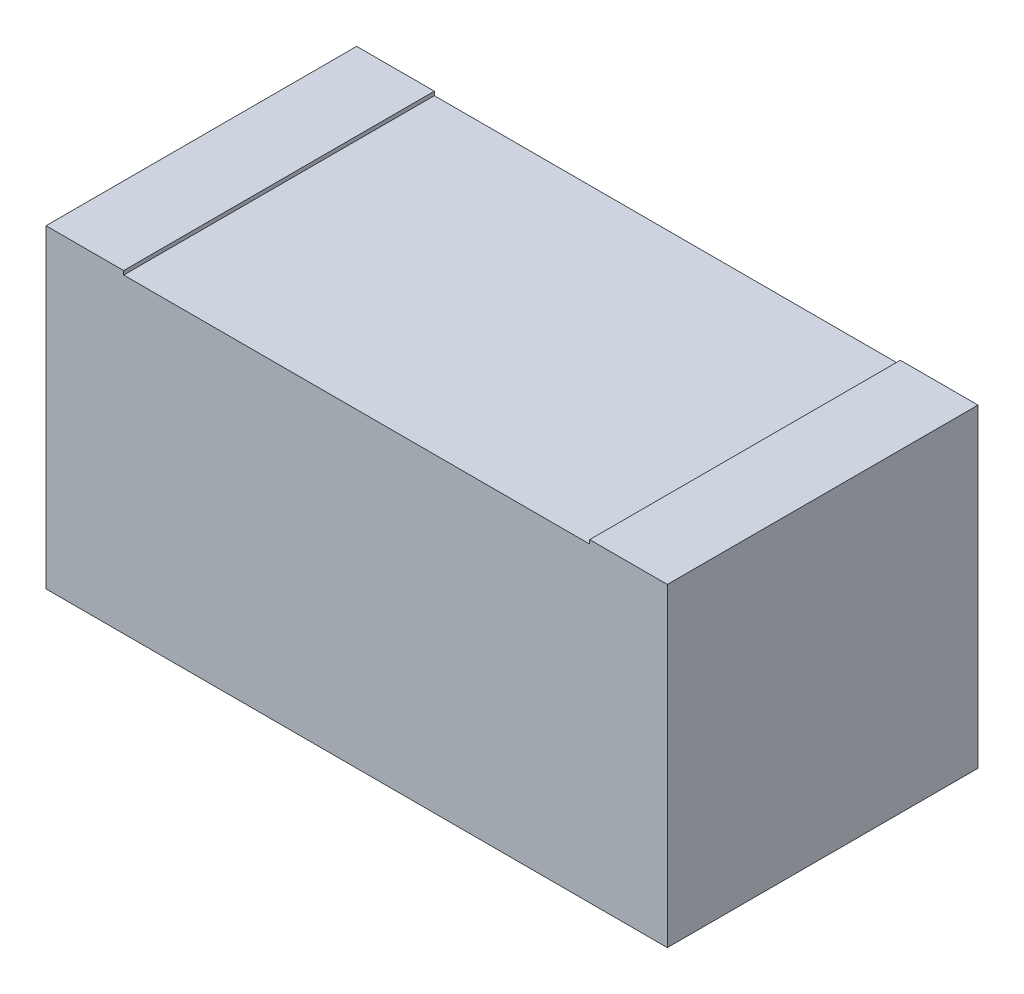
ISO-10303-21;
HEADER;
FILE_DESCRIPTION(('STEP AP214'),'2;1');
FILE_NAME('part.step','',(''),(''),'','','');
FILE_SCHEMA(('AUTOMOTIVE_DESIGN { 1 0 10303 214 1 1 1 1 }'));
ENDSEC;
DATA;
#1=APPLICATION_CONTEXT('core data for automotive mechanical design processes');
#2=APPLICATION_PROTOCOL_DEFINITION('international standard','automotive_design',2000,#1);
#3=PRODUCT_CONTEXT('',#1,'mechanical');
#4=PRODUCT('Part','Part','',(#3));
#5=PRODUCT_RELATED_PRODUCT_CATEGORY('part','',(#4));
#6=PRODUCT_DEFINITION_FORMATION('','',#4);
#7=PRODUCT_DEFINITION_CONTEXT('part definition',#1,'design');
#8=PRODUCT_DEFINITION('design','',#6,#7);
#9=PRODUCT_DEFINITION_SHAPE('','',#8);
#10=(LENGTH_UNIT() NAMED_UNIT(*) SI_UNIT(.MILLI.,.METRE.));
#11=(NAMED_UNIT(*) PLANE_ANGLE_UNIT() SI_UNIT($,.RADIAN.));
#12=(NAMED_UNIT(*) SI_UNIT($,.STERADIAN.) SOLID_ANGLE_UNIT());
#13=UNCERTAINTY_MEASURE_WITH_UNIT(LENGTH_MEASURE(1.E-05),#10,'distance_accuracy_value','');
#14=(GEOMETRIC_REPRESENTATION_CONTEXT(3) GLOBAL_UNCERTAINTY_ASSIGNED_CONTEXT((#13)) GLOBAL_UNIT_ASSIGNED_CONTEXT((#10,
#11,#12)) REPRESENTATION_CONTEXT('',''));
#15=CARTESIAN_POINT('',(0.,0.,0.));
#16=DIRECTION('',(0.,0.,1.));
#17=DIRECTION('',(1.,0.,0.));
#18=AXIS2_PLACEMENT_3D('',#15,#16,#17);
#19=CARTESIAN_POINT('',(0.,0.8,0.));
#20=DIRECTION('',(0.,1.,0.));
#21=DIRECTION('',(0.,0.,1.));
#22=AXIS2_PLACEMENT_3D('',#19,#20,#21);
#23=PLANE('',#22);
#24=DIRECTION('',(1.,0.,0.));
#25=VECTOR('',#24,1.);
#26=CARTESIAN_POINT('',(-0.853781512605042,0.8,0.430252100840336));
#27=LINE('',#26,#25);
#28=CARTESIAN_POINT('',(-0.653781512605042,0.8,0.430252100840336));
#29=VERTEX_POINT('',#28);
#30=CARTESIAN_POINT('',(0.546218487394958,0.8,0.430252100840336));
#31=VERTEX_POINT('',#30);
#32=EDGE_CURVE('E60',#29,#31,#27,.T.);
#33=ORIENTED_EDGE('',*,*,#32,.T.);
#34=DIRECTION('',(0.,0.,1.));
#35=VECTOR('',#34,1.);
#36=CARTESIAN_POINT('',(0.546218487394958,0.8,-0.369747899159664));
#37=LINE('',#36,#35);
#38=CARTESIAN_POINT('',(0.546218487394958,0.8,-0.369747899159664));
#39=VERTEX_POINT('',#38);
#40=EDGE_CURVE('E55',#39,#31,#37,.T.);
#41=ORIENTED_EDGE('',*,*,#40,.F.);
#42=DIRECTION('',(-1.,0.,0.));
#43=VECTOR('',#42,1.);
#44=CARTESIAN_POINT('',(-0.853781512605042,0.8,-0.369747899159664));
#45=LINE('',#44,#43);
#46=CARTESIAN_POINT('',(-0.653781512605042,0.8,-0.369747899159664));
#47=VERTEX_POINT('',#46);
#48=EDGE_CURVE('E158',#39,#47,#45,.T.);
#49=ORIENTED_EDGE('',*,*,#48,.T.);
#50=DIRECTION('',(0.,0.,-1.));
#51=VECTOR('',#50,1.);
#52=CARTESIAN_POINT('',(-0.653781512605042,0.8,-0.369747899159664));
#53=LINE('',#52,#51);
#54=EDGE_CURVE('E137',#29,#47,#53,.T.);
#55=ORIENTED_EDGE('',*,*,#54,.F.);
#56=EDGE_LOOP('',(#33,#41,#49,#55));
#57=FACE_BOUND('',#56,.T.);
#58=ADVANCED_FACE('F40',(#57),#23,.T.);
#59=CARTESIAN_POINT('',(-0.853781512605042,0.8,-0.369747899159664));
#60=DIRECTION('',(1.,0.,0.));
#61=DIRECTION('',(0.,0.,-1.));
#62=AXIS2_PLACEMENT_3D('',#59,#60,#61);
#63=PLANE('',#62);
#64=DIRECTION('',(0.,0.,1.));
#65=VECTOR('',#64,1.);
#66=CARTESIAN_POINT('',(-0.853781512605042,0.,-0.369747899159664));
#67=LINE('',#66,#65);
#68=CARTESIAN_POINT('',(-0.853781512605042,0.,-0.369747899159664));
#69=VERTEX_POINT('',#68);
#70=CARTESIAN_POINT('',(-0.853781512605042,0.,0.430252100840336));
#71=VERTEX_POINT('',#70);
#72=EDGE_CURVE('E156',#69,#71,#67,.T.);
#73=ORIENTED_EDGE('',*,*,#72,.T.);
#74=DIRECTION('',(0.,-1.,0.));
#75=VECTOR('',#74,1.);
#76=CARTESIAN_POINT('',(-0.853781512605042,0.8,0.430252100840336));
#77=LINE('',#76,#75);
#78=CARTESIAN_POINT('',(-0.853781512605042,0.81,0.430252100840336));
#79=VERTEX_POINT('',#78);
#80=EDGE_CURVE('E11',#79,#71,#77,.T.);
#81=ORIENTED_EDGE('',*,*,#80,.F.);
#82=DIRECTION('',(0.,0.,1.));
#83=VECTOR('',#82,1.);
#84=CARTESIAN_POINT('',(-0.853781512605042,0.81,-0.369747899159664));
#85=LINE('',#84,#83);
#86=CARTESIAN_POINT('',(-0.853781512605042,0.81,-0.369747899159664));
#87=VERTEX_POINT('',#86);
#88=EDGE_CURVE('E138',#87,#79,#85,.T.);
#89=ORIENTED_EDGE('',*,*,#88,.F.);
#90=DIRECTION('',(0.,-1.,0.));
#91=VECTOR('',#90,1.);
#92=CARTESIAN_POINT('',(-0.853781512605042,0.8,-0.369747899159664));
#93=LINE('',#92,#91);
#94=EDGE_CURVE('E113',#87,#69,#93,.T.);
#95=ORIENTED_EDGE('',*,*,#94,.T.);
#96=EDGE_LOOP('',(#73,#81,#89,#95));
#97=FACE_BOUND('',#96,.T.);
#98=ADVANCED_FACE('F42',(#97),#63,.F.);
#99=CARTESIAN_POINT('',(-0.853781512605042,0.8,0.430252100840336));
#100=DIRECTION('',(0.,0.,-1.));
#101=DIRECTION('',(-1.,0.,0.));
#102=AXIS2_PLACEMENT_3D('',#99,#100,#101);
#103=PLANE('',#102);
#104=DIRECTION('',(1.,0.,0.));
#105=VECTOR('',#104,1.);
#106=CARTESIAN_POINT('',(-0.853781512605042,0.,0.430252100840336));
#107=LINE('',#106,#105);
#108=CARTESIAN_POINT('',(0.746218487394958,0.,0.430252100840336));
#109=VERTEX_POINT('',#108);
#110=EDGE_CURVE('E163',#71,#109,#107,.T.);
#111=ORIENTED_EDGE('',*,*,#110,.T.);
#112=DIRECTION('',(0.,-1.,0.));
#113=VECTOR('',#112,1.);
#114=CARTESIAN_POINT('',(0.746218487394958,0.8,0.430252100840336));
#115=LINE('',#114,#113);
#116=CARTESIAN_POINT('',(0.746218487394958,0.81,0.430252100840336));
#117=VERTEX_POINT('',#116);
#118=EDGE_CURVE('E48',#117,#109,#115,.T.);
#119=ORIENTED_EDGE('',*,*,#118,.F.);
#120=DIRECTION('',(1.,0.,0.));
#121=VECTOR('',#120,1.);
#122=CARTESIAN_POINT('',(0.746218487394958,0.81,0.430252100840336));
#123=LINE('',#122,#121);
#124=CARTESIAN_POINT('',(0.546218487394958,0.81,0.430252100840336));
#125=VERTEX_POINT('',#124);
#126=EDGE_CURVE('E127',#125,#117,#123,.T.);
#127=ORIENTED_EDGE('',*,*,#126,.F.);
#128=DIRECTION('',(0.,-1.,0.));
#129=VECTOR('',#128,1.);
#130=CARTESIAN_POINT('',(0.546218487394958,0.81,0.430252100840336));
#131=LINE('',#130,#129);
#132=EDGE_CURVE('E132',#125,#31,#131,.T.);
#133=ORIENTED_EDGE('',*,*,#132,.T.);
#134=ORIENTED_EDGE('',*,*,#32,.F.);
#135=DIRECTION('',(0.,-1.,0.));
#136=VECTOR('',#135,1.);
#137=CARTESIAN_POINT('',(-0.653781512605042,0.81,0.430252100840336));
#138=LINE('',#137,#136);
#139=CARTESIAN_POINT('',(-0.653781512605042,0.81,0.430252100840336));
#140=VERTEX_POINT('',#139);
#141=EDGE_CURVE('E153',#140,#29,#138,.T.);
#142=ORIENTED_EDGE('',*,*,#141,.F.);
#143=DIRECTION('',(1.,0.,0.));
#144=VECTOR('',#143,1.);
#145=CARTESIAN_POINT('',(-0.853781512605042,0.81,0.430252100840336));
#146=LINE('',#145,#144);
#147=EDGE_CURVE('E141',#79,#140,#146,.T.);
#148=ORIENTED_EDGE('',*,*,#147,.F.);
#149=ORIENTED_EDGE('',*,*,#80,.T.);
#150=EDGE_LOOP('',(#111,#119,#127,#133,#134,#142,#148,#149));
#151=FACE_BOUND('',#150,.T.);
#152=ADVANCED_FACE('F183',(#151),#103,.F.);
#153=CARTESIAN_POINT('',(0.746218487394958,0.8,-0.369747899159664));
#154=DIRECTION('',(-1.,0.,0.));
#155=DIRECTION('',(0.,0.,1.));
#156=AXIS2_PLACEMENT_3D('',#153,#154,#155);
#157=PLANE('',#156);
#158=DIRECTION('',(0.,0.,-1.));
#159=VECTOR('',#158,1.);
#160=CARTESIAN_POINT('',(0.746218487394958,0.,-0.369747899159664));
#161=LINE('',#160,#159);
#162=CARTESIAN_POINT('',(0.746218487394958,0.,-0.369747899159664));
#163=VERTEX_POINT('',#162);
#164=EDGE_CURVE('E110',#109,#163,#161,.T.);
#165=ORIENTED_EDGE('',*,*,#164,.T.);
#166=DIRECTION('',(0.,-1.,0.));
#167=VECTOR('',#166,1.);
#168=CARTESIAN_POINT('',(0.746218487394958,0.8,-0.369747899159664));
#169=LINE('',#168,#167);
#170=CARTESIAN_POINT('',(0.746218487394958,0.81,-0.369747899159664));
#171=VERTEX_POINT('',#170);
#172=EDGE_CURVE('E103',#171,#163,#169,.T.);
#173=ORIENTED_EDGE('',*,*,#172,.F.);
#174=DIRECTION('',(0.,0.,-1.));
#175=VECTOR('',#174,1.);
#176=CARTESIAN_POINT('',(0.746218487394958,0.81,-0.369747899159664));
#177=LINE('',#176,#175);
#178=EDGE_CURVE('E108',#117,#171,#177,.T.);
#179=ORIENTED_EDGE('',*,*,#178,.F.);
#180=ORIENTED_EDGE('',*,*,#118,.T.);
#181=EDGE_LOOP('',(#165,#173,#179,#180));
#182=FACE_BOUND('',#181,.T.);
#183=ADVANCED_FACE('F105',(#182),#157,.F.);
#184=CARTESIAN_POINT('',(-0.853781512605042,0.8,-0.369747899159664));
#185=DIRECTION('',(0.,0.,1.));
#186=DIRECTION('',(1.,0.,0.));
#187=AXIS2_PLACEMENT_3D('',#184,#185,#186);
#188=PLANE('',#187);
#189=DIRECTION('',(-1.,0.,0.));
#190=VECTOR('',#189,1.);
#191=CARTESIAN_POINT('',(-0.853781512605042,0.,-0.369747899159664));
#192=LINE('',#191,#190);
#193=EDGE_CURVE('E159',#163,#69,#192,.T.);
#194=ORIENTED_EDGE('',*,*,#193,.T.);
#195=ORIENTED_EDGE('',*,*,#94,.F.);
#196=DIRECTION('',(-1.,0.,0.));
#197=VECTOR('',#196,1.);
#198=CARTESIAN_POINT('',(-0.853781512605042,0.81,-0.369747899159664));
#199=LINE('',#198,#197);
#200=CARTESIAN_POINT('',(-0.653781512605042,0.81,-0.369747899159664));
#201=VERTEX_POINT('',#200);
#202=EDGE_CURVE('E145',#201,#87,#199,.T.);
#203=ORIENTED_EDGE('',*,*,#202,.F.);
#204=DIRECTION('',(0.,-1.,0.));
#205=VECTOR('',#204,1.);
#206=CARTESIAN_POINT('',(-0.653781512605042,0.81,-0.369747899159664));
#207=LINE('',#206,#205);
#208=EDGE_CURVE('E148',#201,#47,#207,.T.);
#209=ORIENTED_EDGE('',*,*,#208,.T.);
#210=ORIENTED_EDGE('',*,*,#48,.F.);
#211=DIRECTION('',(0.,-1.,0.));
#212=VECTOR('',#211,1.);
#213=CARTESIAN_POINT('',(0.546218487394958,0.81,-0.369747899159664));
#214=LINE('',#213,#212);
#215=CARTESIAN_POINT('',(0.546218487394958,0.81,-0.369747899159664));
#216=VERTEX_POINT('',#215);
#217=EDGE_CURVE('E119',#216,#39,#214,.T.);
#218=ORIENTED_EDGE('',*,*,#217,.F.);
#219=DIRECTION('',(-1.,0.,0.));
#220=VECTOR('',#219,1.);
#221=CARTESIAN_POINT('',(0.746218487394958,0.81,-0.369747899159664));
#222=LINE('',#221,#220);
#223=EDGE_CURVE('E116',#171,#216,#222,.T.);
#224=ORIENTED_EDGE('',*,*,#223,.F.);
#225=ORIENTED_EDGE('',*,*,#172,.T.);
#226=EDGE_LOOP('',(#194,#195,#203,#209,#210,#218,#224,#225));
#227=FACE_BOUND('',#226,.T.);
#228=ADVANCED_FACE('F117',(#227),#188,.F.);
#229=CARTESIAN_POINT('',(0.,0.,0.));
#230=DIRECTION('',(0.,1.,0.));
#231=DIRECTION('',(0.,0.,1.));
#232=AXIS2_PLACEMENT_3D('',#229,#230,#231);
#233=PLANE('',#232);
#234=ORIENTED_EDGE('',*,*,#72,.F.);
#235=ORIENTED_EDGE('',*,*,#193,.F.);
#236=ORIENTED_EDGE('',*,*,#164,.F.);
#237=ORIENTED_EDGE('',*,*,#110,.F.);
#238=EDGE_LOOP('',(#234,#235,#236,#237));
#239=FACE_BOUND('',#238,.T.);
#240=ADVANCED_FACE('F171',(#239),#233,.F.);
#241=CARTESIAN_POINT('',(-0.653781512605042,0.81,-0.369747899159664));
#242=DIRECTION('',(-1.,0.,0.));
#243=DIRECTION('',(0.,0.,1.));
#244=AXIS2_PLACEMENT_3D('',#241,#242,#243);
#245=PLANE('',#244);
#246=ORIENTED_EDGE('',*,*,#54,.T.);
#247=ORIENTED_EDGE('',*,*,#208,.F.);
#248=DIRECTION('',(0.,0.,-1.));
#249=VECTOR('',#248,1.);
#250=CARTESIAN_POINT('',(-0.653781512605042,0.81,-0.369747899159664));
#251=LINE('',#250,#249);
#252=EDGE_CURVE('E143',#140,#201,#251,.T.);
#253=ORIENTED_EDGE('',*,*,#252,.F.);
#254=ORIENTED_EDGE('',*,*,#141,.T.);
#255=EDGE_LOOP('',(#246,#247,#253,#254));
#256=FACE_BOUND('',#255,.T.);
#257=ADVANCED_FACE('F182',(#256),#245,.F.);
#258=CARTESIAN_POINT('',(0.,0.81,0.));
#259=DIRECTION('',(0.,1.,0.));
#260=DIRECTION('',(0.,0.,1.));
#261=AXIS2_PLACEMENT_3D('',#258,#259,#260);
#262=PLANE('',#261);
#263=ORIENTED_EDGE('',*,*,#88,.T.);
#264=ORIENTED_EDGE('',*,*,#147,.T.);
#265=ORIENTED_EDGE('',*,*,#252,.T.);
#266=ORIENTED_EDGE('',*,*,#202,.T.);
#267=EDGE_LOOP('',(#263,#264,#265,#266));
#268=FACE_BOUND('',#267,.T.);
#269=ADVANCED_FACE('F177',(#268),#262,.T.);
#270=CARTESIAN_POINT('',(0.546218487394958,0.81,-0.369747899159664));
#271=DIRECTION('',(1.,0.,0.));
#272=DIRECTION('',(0.,0.,-1.));
#273=AXIS2_PLACEMENT_3D('',#270,#271,#272);
#274=PLANE('',#273);
#275=ORIENTED_EDGE('',*,*,#40,.T.);
#276=ORIENTED_EDGE('',*,*,#132,.F.);
#277=DIRECTION('',(0.,0.,1.));
#278=VECTOR('',#277,1.);
#279=CARTESIAN_POINT('',(0.546218487394958,0.81,-0.369747899159664));
#280=LINE('',#279,#278);
#281=EDGE_CURVE('E122',#216,#125,#280,.T.);
#282=ORIENTED_EDGE('',*,*,#281,.F.);
#283=ORIENTED_EDGE('',*,*,#217,.T.);
#284=EDGE_LOOP('',(#275,#276,#282,#283));
#285=FACE_BOUND('',#284,.T.);
#286=ADVANCED_FACE('F186',(#285),#274,.F.);
#287=CARTESIAN_POINT('',(0.,0.81,0.));
#288=DIRECTION('',(0.,-1.,0.));
#289=DIRECTION('',(0.,0.,-1.));
#290=AXIS2_PLACEMENT_3D('',#287,#288,#289);
#291=PLANE('',#290);
#292=ORIENTED_EDGE('',*,*,#178,.T.);
#293=ORIENTED_EDGE('',*,*,#223,.T.);
#294=ORIENTED_EDGE('',*,*,#281,.T.);
#295=ORIENTED_EDGE('',*,*,#126,.T.);
#296=EDGE_LOOP('',(#292,#293,#294,#295));
#297=FACE_BOUND('',#296,.T.);
#298=ADVANCED_FACE('F125',(#297),#291,.F.);
#299=CLOSED_SHELL('',(#58,#98,#152,#183,#228,#240,#257,#269,#286,#298));
#300=MANIFOLD_SOLID_BREP('B2',#299);
#301=ADVANCED_BREP_SHAPE_REPRESENTATION('',(#18,#300),#14);
#302=SHAPE_DEFINITION_REPRESENTATION(#9,#301);
ENDSEC;
END-ISO-10303-21;
